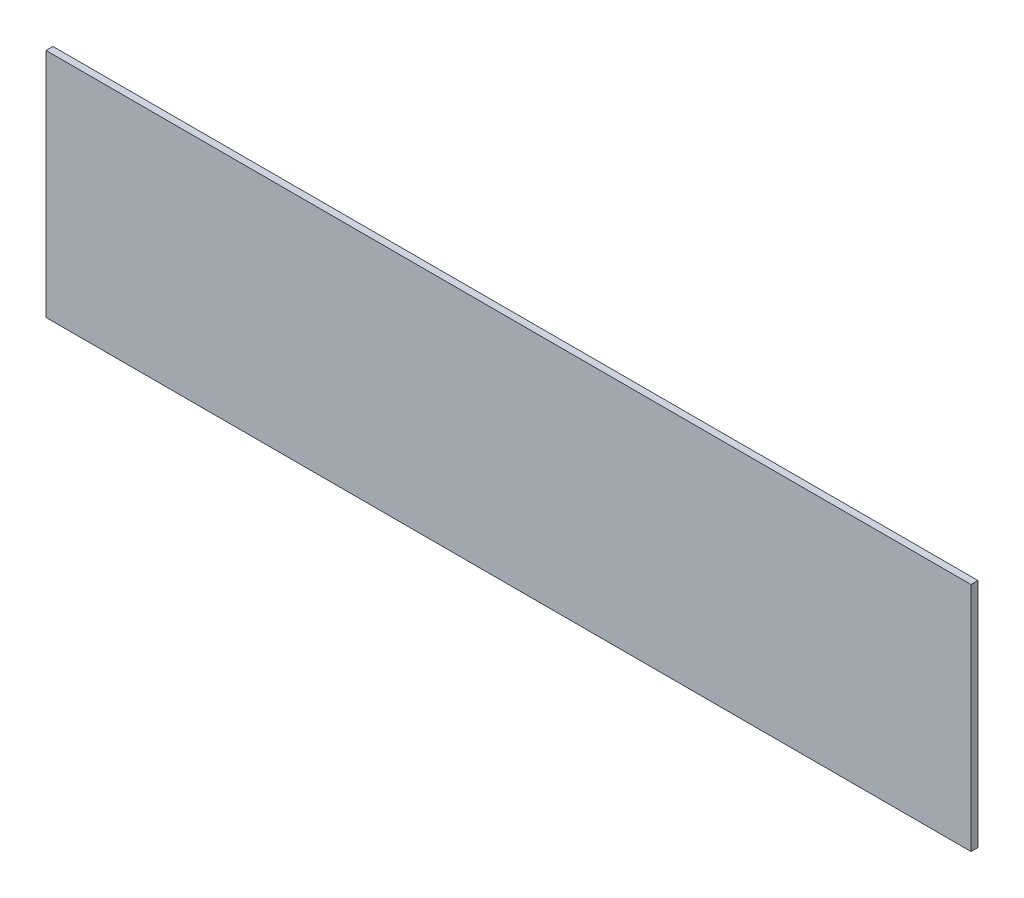
ISO-10303-21;
HEADER;
FILE_DESCRIPTION(('STEP AP214'),'2;1');
FILE_NAME('part.step','',(''),(''),'','','');
FILE_SCHEMA(('AUTOMOTIVE_DESIGN { 1 0 10303 214 1 1 1 1 }'));
ENDSEC;
DATA;
#1=APPLICATION_CONTEXT('core data for automotive mechanical design processes');
#2=APPLICATION_PROTOCOL_DEFINITION('international standard','automotive_design',2000,#1);
#3=PRODUCT_CONTEXT('',#1,'mechanical');
#4=PRODUCT('Part','Part','',(#3));
#5=PRODUCT_RELATED_PRODUCT_CATEGORY('part','',(#4));
#6=PRODUCT_DEFINITION_FORMATION('','',#4);
#7=PRODUCT_DEFINITION_CONTEXT('part definition',#1,'design');
#8=PRODUCT_DEFINITION('design','',#6,#7);
#9=PRODUCT_DEFINITION_SHAPE('','',#8);
#10=(LENGTH_UNIT() NAMED_UNIT(*) SI_UNIT(.MILLI.,.METRE.));
#11=(NAMED_UNIT(*) PLANE_ANGLE_UNIT() SI_UNIT($,.RADIAN.));
#12=(NAMED_UNIT(*) SI_UNIT($,.STERADIAN.) SOLID_ANGLE_UNIT());
#13=UNCERTAINTY_MEASURE_WITH_UNIT(LENGTH_MEASURE(1.E-05),#10,'distance_accuracy_value','');
#14=(GEOMETRIC_REPRESENTATION_CONTEXT(3) GLOBAL_UNCERTAINTY_ASSIGNED_CONTEXT((#13)) GLOBAL_UNIT_ASSIGNED_CONTEXT((#10,
#11,#12)) REPRESENTATION_CONTEXT('',''));
#15=CARTESIAN_POINT('',(0.,0.,0.));
#16=DIRECTION('',(0.,0.,1.));
#17=DIRECTION('',(1.,0.,0.));
#18=AXIS2_PLACEMENT_3D('',#15,#16,#17);
#19=CARTESIAN_POINT('',(0.,0.,3.));
#20=DIRECTION('',(0.,1.,0.));
#21=DIRECTION('',(0.,0.,1.));
#22=AXIS2_PLACEMENT_3D('',#19,#20,#21);
#23=PLANE('',#22);
#24=DIRECTION('',(1.,0.,0.));
#25=VECTOR('',#24,1.);
#26=CARTESIAN_POINT('',(0.,0.,3.));
#27=LINE('',#26,#25);
#28=CARTESIAN_POINT('',(7.99999999999999,0.,3.));
#29=VERTEX_POINT('',#28);
#30=CARTESIAN_POINT('',(408.,0.,3.));
#31=VERTEX_POINT('',#30);
#32=EDGE_CURVE('E85',#29,#31,#27,.T.);
#33=ORIENTED_EDGE('',*,*,#32,.F.);
#34=DIRECTION('',(0.,0.,-1.));
#35=VECTOR('',#34,1.);
#36=CARTESIAN_POINT('',(7.99999999999999,0.,10.));
#37=LINE('',#36,#35);
#38=CARTESIAN_POINT('',(7.99999999999999,0.,0.));
#39=VERTEX_POINT('',#38);
#40=EDGE_CURVE('E95',#29,#39,#37,.T.);
#41=ORIENTED_EDGE('',*,*,#40,.T.);
#42=DIRECTION('',(1.,0.,0.));
#43=VECTOR('',#42,1.);
#44=CARTESIAN_POINT('',(0.,0.,0.));
#45=LINE('',#44,#43);
#46=CARTESIAN_POINT('',(408.,0.,0.));
#47=VERTEX_POINT('',#46);
#48=EDGE_CURVE('E77',#39,#47,#45,.T.);
#49=ORIENTED_EDGE('',*,*,#48,.T.);
#50=DIRECTION('',(0.,0.,-1.));
#51=VECTOR('',#50,1.);
#52=CARTESIAN_POINT('',(408.,0.,3.));
#53=LINE('',#52,#51);
#54=EDGE_CURVE('E11',#31,#47,#53,.T.);
#55=ORIENTED_EDGE('',*,*,#54,.F.);
#56=EDGE_LOOP('',(#33,#41,#49,#55));
#57=FACE_BOUND('',#56,.T.);
#58=ADVANCED_FACE('F33',(#57),#23,.F.);
#59=CARTESIAN_POINT('',(408.,0.,3.));
#60=DIRECTION('',(-1.,0.,0.));
#61=DIRECTION('',(0.,0.,1.));
#62=AXIS2_PLACEMENT_3D('',#59,#60,#61);
#63=PLANE('',#62);
#64=DIRECTION('',(0.,1.,0.));
#65=VECTOR('',#64,1.);
#66=CARTESIAN_POINT('',(408.,0.,0.));
#67=LINE('',#66,#65);
#68=CARTESIAN_POINT('',(408.,100.,0.));
#69=VERTEX_POINT('',#68);
#70=EDGE_CURVE('E68',#47,#69,#67,.T.);
#71=ORIENTED_EDGE('',*,*,#70,.T.);
#72=DIRECTION('',(0.,0.,-1.));
#73=VECTOR('',#72,1.);
#74=CARTESIAN_POINT('',(408.,100.,3.));
#75=LINE('',#74,#73);
#76=CARTESIAN_POINT('',(408.,100.,3.));
#77=VERTEX_POINT('',#76);
#78=EDGE_CURVE('E40',#77,#69,#75,.T.);
#79=ORIENTED_EDGE('',*,*,#78,.F.);
#80=DIRECTION('',(0.,1.,0.));
#81=VECTOR('',#80,1.);
#82=CARTESIAN_POINT('',(408.,0.,3.));
#83=LINE('',#82,#81);
#84=EDGE_CURVE('E56',#31,#77,#83,.T.);
#85=ORIENTED_EDGE('',*,*,#84,.F.);
#86=ORIENTED_EDGE('',*,*,#54,.T.);
#87=EDGE_LOOP('',(#71,#79,#85,#86));
#88=FACE_BOUND('',#87,.T.);
#89=ADVANCED_FACE('F70',(#88),#63,.F.);
#90=CARTESIAN_POINT('',(0.,100.,3.));
#91=DIRECTION('',(0.,-1.,0.));
#92=DIRECTION('',(0.,0.,-1.));
#93=AXIS2_PLACEMENT_3D('',#90,#91,#92);
#94=PLANE('',#93);
#95=DIRECTION('',(-1.,0.,0.));
#96=VECTOR('',#95,1.);
#97=CARTESIAN_POINT('',(0.,100.,0.));
#98=LINE('',#97,#96);
#99=CARTESIAN_POINT('',(8.,100.,0.));
#100=VERTEX_POINT('',#99);
#101=EDGE_CURVE('E76',#69,#100,#98,.T.);
#102=ORIENTED_EDGE('',*,*,#101,.T.);
#103=DIRECTION('',(0.,0.,-1.));
#104=VECTOR('',#103,1.);
#105=CARTESIAN_POINT('',(8.,100.,10.));
#106=LINE('',#105,#104);
#107=CARTESIAN_POINT('',(8.,100.,3.));
#108=VERTEX_POINT('',#107);
#109=EDGE_CURVE('E47',#108,#100,#106,.T.);
#110=ORIENTED_EDGE('',*,*,#109,.F.);
#111=DIRECTION('',(-1.,0.,0.));
#112=VECTOR('',#111,1.);
#113=CARTESIAN_POINT('',(0.,100.,3.));
#114=LINE('',#113,#112);
#115=EDGE_CURVE('E82',#77,#108,#114,.T.);
#116=ORIENTED_EDGE('',*,*,#115,.F.);
#117=ORIENTED_EDGE('',*,*,#78,.T.);
#118=EDGE_LOOP('',(#102,#110,#116,#117));
#119=FACE_BOUND('',#118,.T.);
#120=ADVANCED_FACE('F81',(#119),#94,.F.);
#121=CARTESIAN_POINT('',(0.,0.,3.));
#122=DIRECTION('',(0.,0.,-1.));
#123=DIRECTION('',(-1.,0.,0.));
#124=AXIS2_PLACEMENT_3D('',#121,#122,#123);
#125=PLANE('',#124);
#126=ORIENTED_EDGE('',*,*,#115,.T.);
#127=DIRECTION('',(0.,-1.,0.));
#128=VECTOR('',#127,1.);
#129=CARTESIAN_POINT('',(7.99999999999999,0.,3.));
#130=LINE('',#129,#128);
#131=EDGE_CURVE('E90',#108,#29,#130,.T.);
#132=ORIENTED_EDGE('',*,*,#131,.T.);
#133=ORIENTED_EDGE('',*,*,#32,.T.);
#134=ORIENTED_EDGE('',*,*,#84,.T.);
#135=EDGE_LOOP('',(#126,#132,#133,#134));
#136=FACE_BOUND('',#135,.T.);
#137=ADVANCED_FACE('F106',(#136),#125,.F.);
#138=CARTESIAN_POINT('',(0.,0.,0.));
#139=DIRECTION('',(0.,0.,-1.));
#140=DIRECTION('',(-1.,0.,0.));
#141=AXIS2_PLACEMENT_3D('',#138,#139,#140);
#142=PLANE('',#141);
#143=DIRECTION('',(0.,-1.,0.));
#144=VECTOR('',#143,1.);
#145=CARTESIAN_POINT('',(8.,100.,0.));
#146=LINE('',#145,#144);
#147=EDGE_CURVE('E84',#100,#39,#146,.T.);
#148=ORIENTED_EDGE('',*,*,#147,.F.);
#149=ORIENTED_EDGE('',*,*,#101,.F.);
#150=ORIENTED_EDGE('',*,*,#70,.F.);
#151=ORIENTED_EDGE('',*,*,#48,.F.);
#152=EDGE_LOOP('',(#148,#149,#150,#151));
#153=FACE_BOUND('',#152,.T.);
#154=ADVANCED_FACE('F83',(#153),#142,.T.);
#155=CARTESIAN_POINT('',(8.,100.,10.));
#156=DIRECTION('',(1.,0.,0.));
#157=DIRECTION('',(0.,1.,0.));
#158=AXIS2_PLACEMENT_3D('',#155,#156,#157);
#159=PLANE('',#158);
#160=ORIENTED_EDGE('',*,*,#109,.T.);
#161=ORIENTED_EDGE('',*,*,#147,.T.);
#162=ORIENTED_EDGE('',*,*,#40,.F.);
#163=ORIENTED_EDGE('',*,*,#131,.F.);
#164=EDGE_LOOP('',(#160,#161,#162,#163));
#165=FACE_BOUND('',#164,.T.);
#166=ADVANCED_FACE('F101',(#165),#159,.F.);
#167=CLOSED_SHELL('',(#58,#89,#120,#137,#154,#166));
#168=MANIFOLD_SOLID_BREP('B2',#167);
#169=ADVANCED_BREP_SHAPE_REPRESENTATION('',(#18,#168),#14);
#170=SHAPE_DEFINITION_REPRESENTATION(#9,#169);
ENDSEC;
END-ISO-10303-21;
